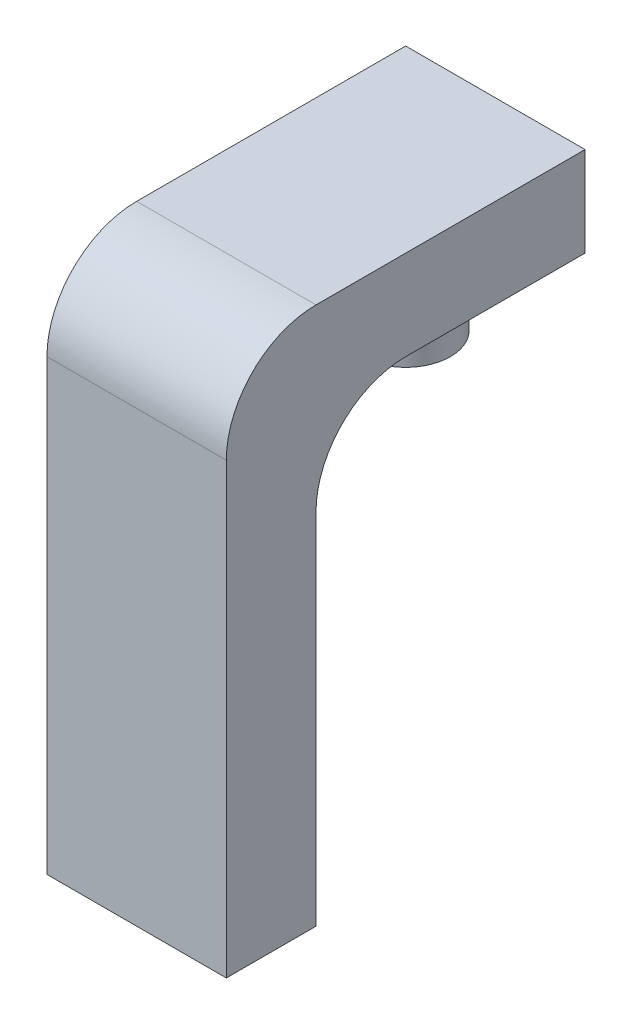
ISO-10303-21;
HEADER;
FILE_DESCRIPTION(('STEP AP214'),'2;1');
FILE_NAME('part.step','',(''),(''),'','','');
FILE_SCHEMA(('AUTOMOTIVE_DESIGN { 1 0 10303 214 1 1 1 1 }'));
ENDSEC;
DATA;
#1=APPLICATION_CONTEXT('core data for automotive mechanical design processes');
#2=APPLICATION_PROTOCOL_DEFINITION('international standard','automotive_design',2000,#1);
#3=PRODUCT_CONTEXT('',#1,'mechanical');
#4=PRODUCT('Part','Part','',(#3));
#5=PRODUCT_RELATED_PRODUCT_CATEGORY('part','',(#4));
#6=PRODUCT_DEFINITION_FORMATION('','',#4);
#7=PRODUCT_DEFINITION_CONTEXT('part definition',#1,'design');
#8=PRODUCT_DEFINITION('design','',#6,#7);
#9=PRODUCT_DEFINITION_SHAPE('','',#8);
#10=(LENGTH_UNIT() NAMED_UNIT(*) SI_UNIT(.MILLI.,.METRE.));
#11=(NAMED_UNIT(*) PLANE_ANGLE_UNIT() SI_UNIT($,.RADIAN.));
#12=(NAMED_UNIT(*) SI_UNIT($,.STERADIAN.) SOLID_ANGLE_UNIT());
#13=UNCERTAINTY_MEASURE_WITH_UNIT(LENGTH_MEASURE(1.E-05),#10,'distance_accuracy_value','');
#14=(GEOMETRIC_REPRESENTATION_CONTEXT(3) GLOBAL_UNCERTAINTY_ASSIGNED_CONTEXT((#13)) GLOBAL_UNIT_ASSIGNED_CONTEXT((#10,
#11,#12)) REPRESENTATION_CONTEXT('',''));
#15=CARTESIAN_POINT('',(0.,0.,0.));
#16=DIRECTION('',(0.,0.,1.));
#17=DIRECTION('',(1.,0.,0.));
#18=AXIS2_PLACEMENT_3D('',#15,#16,#17);
#19=CARTESIAN_POINT('',(50.8,0.,0.));
#20=DIRECTION('',(0.,0.,-1.));
#21=DIRECTION('',(-1.,0.,0.));
#22=AXIS2_PLACEMENT_3D('',#19,#20,#21);
#23=PLANE('',#22);
#24=DIRECTION('',(0.,-1.,0.));
#25=VECTOR('',#24,1.);
#26=CARTESIAN_POINT('',(0.,0.,0.));
#27=LINE('',#26,#25);
#28=CARTESIAN_POINT('',(0.,127.,0.));
#29=VERTEX_POINT('',#28);
#30=CARTESIAN_POINT('',(0.,0.,0.));
#31=VERTEX_POINT('',#30);
#32=EDGE_CURVE('E129',#29,#31,#27,.T.);
#33=ORIENTED_EDGE('',*,*,#32,.T.);
#34=DIRECTION('',(-1.,0.,0.));
#35=VECTOR('',#34,1.);
#36=CARTESIAN_POINT('',(50.8,0.,0.));
#37=LINE('',#36,#35);
#38=CARTESIAN_POINT('',(50.8,0.,0.));
#39=VERTEX_POINT('',#38);
#40=EDGE_CURVE('E40',#39,#31,#37,.T.);
#41=ORIENTED_EDGE('',*,*,#40,.F.);
#42=DIRECTION('',(0.,-1.,0.));
#43=VECTOR('',#42,1.);
#44=CARTESIAN_POINT('',(50.8,0.,0.));
#45=LINE('',#44,#43);
#46=CARTESIAN_POINT('',(50.8,127.,0.));
#47=VERTEX_POINT('',#46);
#48=EDGE_CURVE('E144',#47,#39,#45,.T.);
#49=ORIENTED_EDGE('',*,*,#48,.F.);
#50=DIRECTION('',(-1.,0.,0.));
#51=VECTOR('',#50,1.);
#52=CARTESIAN_POINT('',(50.8,127.,0.));
#53=LINE('',#52,#51);
#54=EDGE_CURVE('E125',#47,#29,#53,.T.);
#55=ORIENTED_EDGE('',*,*,#54,.T.);
#56=EDGE_LOOP('',(#33,#41,#49,#55));
#57=FACE_BOUND('',#56,.T.);
#58=ADVANCED_FACE('F32',(#57),#23,.F.);
#59=CARTESIAN_POINT('',(50.8,0.,0.));
#60=DIRECTION('',(0.,1.,0.));
#61=DIRECTION('',(0.,0.,1.));
#62=AXIS2_PLACEMENT_3D('',#59,#60,#61);
#63=PLANE('',#62);
#64=DIRECTION('',(0.,0.,-1.));
#65=VECTOR('',#64,1.);
#66=CARTESIAN_POINT('',(0.,0.,0.));
#67=LINE('',#66,#65);
#68=CARTESIAN_POINT('',(0.,0.,-25.4));
#69=VERTEX_POINT('',#68);
#70=EDGE_CURVE('E132',#31,#69,#67,.T.);
#71=ORIENTED_EDGE('',*,*,#70,.T.);
#72=DIRECTION('',(-1.,0.,0.));
#73=VECTOR('',#72,1.);
#74=CARTESIAN_POINT('',(50.8,0.,-25.4));
#75=LINE('',#74,#73);
#76=CARTESIAN_POINT('',(50.8,0.,-25.4));
#77=VERTEX_POINT('',#76);
#78=EDGE_CURVE('E154',#77,#69,#75,.T.);
#79=ORIENTED_EDGE('',*,*,#78,.F.);
#80=DIRECTION('',(0.,0.,-1.));
#81=VECTOR('',#80,1.);
#82=CARTESIAN_POINT('',(50.8,0.,0.));
#83=LINE('',#82,#81);
#84=EDGE_CURVE('E92',#39,#77,#83,.T.);
#85=ORIENTED_EDGE('',*,*,#84,.F.);
#86=ORIENTED_EDGE('',*,*,#40,.T.);
#87=EDGE_LOOP('',(#71,#79,#85,#86));
#88=FACE_BOUND('',#87,.T.);
#89=ADVANCED_FACE('F157',(#88),#63,.F.);
#90=CARTESIAN_POINT('',(50.8,101.6,-25.4));
#91=DIRECTION('',(0.,0.,1.));
#92=DIRECTION('',(0.,-1.,0.));
#93=AXIS2_PLACEMENT_3D('',#90,#91,#92);
#94=PLANE('',#93);
#95=DIRECTION('',(0.,1.,0.));
#96=VECTOR('',#95,1.);
#97=CARTESIAN_POINT('',(0.,101.6,-25.4));
#98=LINE('',#97,#96);
#99=CARTESIAN_POINT('',(0.,101.6,-25.4));
#100=VERTEX_POINT('',#99);
#101=EDGE_CURVE('E135',#69,#100,#98,.T.);
#102=ORIENTED_EDGE('',*,*,#101,.T.);
#103=DIRECTION('',(-1.,0.,0.));
#104=VECTOR('',#103,1.);
#105=CARTESIAN_POINT('',(50.8,101.6,-25.4));
#106=LINE('',#105,#104);
#107=CARTESIAN_POINT('',(50.8,101.6,-25.4));
#108=VERTEX_POINT('',#107);
#109=EDGE_CURVE('E151',#108,#100,#106,.T.);
#110=ORIENTED_EDGE('',*,*,#109,.F.);
#111=DIRECTION('',(0.,1.,0.));
#112=VECTOR('',#111,1.);
#113=CARTESIAN_POINT('',(50.8,101.6,-25.4));
#114=LINE('',#113,#112);
#115=EDGE_CURVE('E175',#77,#108,#114,.T.);
#116=ORIENTED_EDGE('',*,*,#115,.F.);
#117=ORIENTED_EDGE('',*,*,#78,.T.);
#118=EDGE_LOOP('',(#102,#110,#116,#117));
#119=FACE_BOUND('',#118,.T.);
#120=ADVANCED_FACE('F168',(#119),#94,.F.);
#121=CARTESIAN_POINT('',(50.8,101.6,-50.8));
#122=DIRECTION('',(-1.,0.,0.));
#123=DIRECTION('',(0.,0.,1.));
#124=AXIS2_PLACEMENT_3D('',#121,#122,#123);
#125=CYLINDRICAL_SURFACE('',#124,25.4);
#126=CARTESIAN_POINT('',(0.,101.6,-50.8));
#127=DIRECTION('',(-1.,0.,0.));
#128=DIRECTION('',(0.,0.,-1.));
#129=AXIS2_PLACEMENT_3D('',#126,#127,#128);
#130=CIRCLE('',#129,25.4);
#131=CARTESIAN_POINT('',(0.,127.,-50.8));
#132=VERTEX_POINT('',#131);
#133=EDGE_CURVE('E137',#100,#132,#130,.T.);
#134=ORIENTED_EDGE('',*,*,#133,.T.);
#135=DIRECTION('',(-1.,0.,0.));
#136=VECTOR('',#135,1.);
#137=CARTESIAN_POINT('',(50.8,127.,-50.8));
#138=LINE('',#137,#136);
#139=CARTESIAN_POINT('',(50.8,127.,-50.8));
#140=VERTEX_POINT('',#139);
#141=EDGE_CURVE('E148',#140,#132,#138,.T.);
#142=ORIENTED_EDGE('',*,*,#141,.F.);
#143=CARTESIAN_POINT('',(50.8,101.6,-50.8));
#144=DIRECTION('',(-1.,0.,0.));
#145=DIRECTION('',(0.,0.,-1.));
#146=AXIS2_PLACEMENT_3D('',#143,#144,#145);
#147=CIRCLE('',#146,25.4);
#148=EDGE_CURVE('E174',#108,#140,#147,.T.);
#149=ORIENTED_EDGE('',*,*,#148,.F.);
#150=ORIENTED_EDGE('',*,*,#109,.T.);
#151=EDGE_LOOP('',(#134,#142,#149,#150));
#152=FACE_BOUND('',#151,.T.);
#153=ADVANCED_FACE('F172',(#152),#125,.F.);
#154=CARTESIAN_POINT('',(50.8,127.,-101.6));
#155=DIRECTION('',(0.,1.,0.));
#156=DIRECTION('',(0.,0.,1.));
#157=AXIS2_PLACEMENT_3D('',#154,#155,#156);
#158=PLANE('',#157);
#159=CARTESIAN_POINT('',(25.4,127.,-76.2));
#160=DIRECTION('',(0.,1.,0.));
#161=DIRECTION('',(0.,0.,1.));
#162=AXIS2_PLACEMENT_3D('',#159,#160,#161);
#163=CIRCLE('',#162,12.7);
#164=CARTESIAN_POINT('',(25.4,127.,-63.5));
#165=VERTEX_POINT('',#164);
#166=EDGE_CURVE('E11',#165,#165,#163,.F.);
#167=ORIENTED_EDGE('',*,*,#166,.F.);
#168=EDGE_LOOP('',(#167));
#169=FACE_BOUND('',#168,.T.);
#170=DIRECTION('',(0.,0.,-1.));
#171=VECTOR('',#170,1.);
#172=CARTESIAN_POINT('',(0.,127.,-101.6));
#173=LINE('',#172,#171);
#174=CARTESIAN_POINT('',(0.,127.,-101.6));
#175=VERTEX_POINT('',#174);
#176=EDGE_CURVE('E139',#132,#175,#173,.T.);
#177=ORIENTED_EDGE('',*,*,#176,.T.);
#178=DIRECTION('',(-1.,0.,0.));
#179=VECTOR('',#178,1.);
#180=CARTESIAN_POINT('',(50.8,127.,-101.6));
#181=LINE('',#180,#179);
#182=CARTESIAN_POINT('',(50.8,127.,-101.6));
#183=VERTEX_POINT('',#182);
#184=EDGE_CURVE('E120',#183,#175,#181,.T.);
#185=ORIENTED_EDGE('',*,*,#184,.F.);
#186=DIRECTION('',(0.,0.,-1.));
#187=VECTOR('',#186,1.);
#188=CARTESIAN_POINT('',(50.8,127.,-101.6));
#189=LINE('',#188,#187);
#190=EDGE_CURVE('E111',#140,#183,#189,.T.);
#191=ORIENTED_EDGE('',*,*,#190,.F.);
#192=ORIENTED_EDGE('',*,*,#141,.T.);
#193=EDGE_LOOP('',(#177,#185,#191,#192));
#194=FACE_BOUND('',#193,.T.);
#195=ADVANCED_FACE('F192',(#169,#194),#158,.F.);
#196=CARTESIAN_POINT('',(50.8,152.4,-101.6));
#197=DIRECTION('',(0.,0.,1.));
#198=DIRECTION('',(1.,0.,0.));
#199=AXIS2_PLACEMENT_3D('',#196,#197,#198);
#200=PLANE('',#199);
#201=DIRECTION('',(0.,1.,0.));
#202=VECTOR('',#201,1.);
#203=CARTESIAN_POINT('',(0.,152.4,-101.6));
#204=LINE('',#203,#202);
#205=CARTESIAN_POINT('',(0.,152.4,-101.6));
#206=VERTEX_POINT('',#205);
#207=EDGE_CURVE('E119',#175,#206,#204,.T.);
#208=ORIENTED_EDGE('',*,*,#207,.T.);
#209=DIRECTION('',(-1.,0.,0.));
#210=VECTOR('',#209,1.);
#211=CARTESIAN_POINT('',(50.8,152.4,-101.6));
#212=LINE('',#211,#210);
#213=CARTESIAN_POINT('',(50.8,152.4,-101.6));
#214=VERTEX_POINT('',#213);
#215=EDGE_CURVE('E116',#214,#206,#212,.T.);
#216=ORIENTED_EDGE('',*,*,#215,.F.);
#217=DIRECTION('',(0.,1.,0.));
#218=VECTOR('',#217,1.);
#219=CARTESIAN_POINT('',(50.8,152.4,-101.6));
#220=LINE('',#219,#218);
#221=EDGE_CURVE('E105',#183,#214,#220,.T.);
#222=ORIENTED_EDGE('',*,*,#221,.F.);
#223=ORIENTED_EDGE('',*,*,#184,.T.);
#224=EDGE_LOOP('',(#208,#216,#222,#223));
#225=FACE_BOUND('',#224,.T.);
#226=ADVANCED_FACE('F117',(#225),#200,.F.);
#227=CARTESIAN_POINT('',(50.8,152.4,-25.4));
#228=DIRECTION('',(0.,-1.,0.));
#229=DIRECTION('',(0.,0.,-1.));
#230=AXIS2_PLACEMENT_3D('',#227,#228,#229);
#231=PLANE('',#230);
#232=DIRECTION('',(0.,0.,1.));
#233=VECTOR('',#232,1.);
#234=CARTESIAN_POINT('',(0.,152.4,-25.4));
#235=LINE('',#234,#233);
#236=CARTESIAN_POINT('',(0.,152.4,-25.4));
#237=VERTEX_POINT('',#236);
#238=EDGE_CURVE('E77',#206,#237,#235,.T.);
#239=ORIENTED_EDGE('',*,*,#238,.T.);
#240=DIRECTION('',(-1.,0.,0.));
#241=VECTOR('',#240,1.);
#242=CARTESIAN_POINT('',(50.8,152.4,-25.4));
#243=LINE('',#242,#241);
#244=CARTESIAN_POINT('',(50.8,152.4,-25.4));
#245=VERTEX_POINT('',#244);
#246=EDGE_CURVE('E121',#245,#237,#243,.T.);
#247=ORIENTED_EDGE('',*,*,#246,.F.);
#248=DIRECTION('',(0.,0.,1.));
#249=VECTOR('',#248,1.);
#250=CARTESIAN_POINT('',(50.8,152.4,-25.4));
#251=LINE('',#250,#249);
#252=EDGE_CURVE('E109',#214,#245,#251,.T.);
#253=ORIENTED_EDGE('',*,*,#252,.F.);
#254=ORIENTED_EDGE('',*,*,#215,.T.);
#255=EDGE_LOOP('',(#239,#247,#253,#254));
#256=FACE_BOUND('',#255,.T.);
#257=ADVANCED_FACE('F123',(#256),#231,.F.);
#258=CARTESIAN_POINT('',(50.8,127.,-25.4));
#259=DIRECTION('',(-1.,0.,0.));
#260=DIRECTION('',(0.,0.,1.));
#261=AXIS2_PLACEMENT_3D('',#258,#259,#260);
#262=CYLINDRICAL_SURFACE('',#261,25.4);
#263=CARTESIAN_POINT('',(0.,127.,-25.4));
#264=DIRECTION('',(1.,0.,0.));
#265=DIRECTION('',(0.,0.,1.));
#266=AXIS2_PLACEMENT_3D('',#263,#264,#265);
#267=CIRCLE('',#266,25.4);
#268=EDGE_CURVE('E83',#237,#29,#267,.T.);
#269=ORIENTED_EDGE('',*,*,#268,.T.);
#270=ORIENTED_EDGE('',*,*,#54,.F.);
#271=CARTESIAN_POINT('',(50.8,127.,-25.4));
#272=DIRECTION('',(1.,0.,0.));
#273=DIRECTION('',(0.,0.,1.));
#274=AXIS2_PLACEMENT_3D('',#271,#272,#273);
#275=CIRCLE('',#274,25.4);
#276=EDGE_CURVE('E48',#245,#47,#275,.T.);
#277=ORIENTED_EDGE('',*,*,#276,.F.);
#278=ORIENTED_EDGE('',*,*,#246,.T.);
#279=EDGE_LOOP('',(#269,#270,#277,#278));
#280=FACE_BOUND('',#279,.T.);
#281=ADVANCED_FACE('F232',(#280),#262,.T.);
#282=CARTESIAN_POINT('',(50.8,127.,-25.4));
#283=DIRECTION('',(-1.,0.,0.));
#284=DIRECTION('',(0.,0.,1.));
#285=AXIS2_PLACEMENT_3D('',#282,#283,#284);
#286=PLANE('',#285);
#287=ORIENTED_EDGE('',*,*,#48,.T.);
#288=ORIENTED_EDGE('',*,*,#84,.T.);
#289=ORIENTED_EDGE('',*,*,#115,.T.);
#290=ORIENTED_EDGE('',*,*,#148,.T.);
#291=ORIENTED_EDGE('',*,*,#190,.T.);
#292=ORIENTED_EDGE('',*,*,#221,.T.);
#293=ORIENTED_EDGE('',*,*,#252,.T.);
#294=ORIENTED_EDGE('',*,*,#276,.T.);
#295=EDGE_LOOP('',(#287,#288,#289,#290,#291,#292,#293,#294));
#296=FACE_BOUND('',#295,.T.);
#297=ADVANCED_FACE('F107',(#296),#286,.F.);
#298=CARTESIAN_POINT('',(0.,127.,-25.4));
#299=DIRECTION('',(-1.,0.,0.));
#300=DIRECTION('',(0.,0.,1.));
#301=AXIS2_PLACEMENT_3D('',#298,#299,#300);
#302=PLANE('',#301);
#303=ORIENTED_EDGE('',*,*,#32,.F.);
#304=ORIENTED_EDGE('',*,*,#268,.F.);
#305=ORIENTED_EDGE('',*,*,#238,.F.);
#306=ORIENTED_EDGE('',*,*,#207,.F.);
#307=ORIENTED_EDGE('',*,*,#176,.F.);
#308=ORIENTED_EDGE('',*,*,#133,.F.);
#309=ORIENTED_EDGE('',*,*,#101,.F.);
#310=ORIENTED_EDGE('',*,*,#70,.F.);
#311=EDGE_LOOP('',(#303,#304,#305,#306,#307,#308,#309,#310));
#312=FACE_BOUND('',#311,.T.);
#313=ADVANCED_FACE('F162',(#312),#302,.T.);
#314=CARTESIAN_POINT('',(25.4,107.95,-76.2));
#315=DIRECTION('',(0.,1.,0.));
#316=DIRECTION('',(0.,0.,1.));
#317=AXIS2_PLACEMENT_3D('',#314,#315,#316);
#318=CYLINDRICAL_SURFACE('',#317,12.7);
#319=CARTESIAN_POINT('',(25.4,107.95,-76.2));
#320=DIRECTION('',(0.,-1.,0.));
#321=DIRECTION('',(0.,0.,-1.));
#322=AXIS2_PLACEMENT_3D('',#319,#320,#321);
#323=CIRCLE('',#322,12.7);
#324=CARTESIAN_POINT('',(25.4,107.95,-88.9));
#325=VERTEX_POINT('',#324);
#326=EDGE_CURVE('E133',#325,#325,#323,.T.);
#327=ORIENTED_EDGE('',*,*,#326,.F.);
#328=EDGE_LOOP('',(#327));
#329=FACE_BOUND('',#328,.T.);
#330=ORIENTED_EDGE('',*,*,#166,.T.);
#331=EDGE_LOOP('',(#330));
#332=FACE_BOUND('',#331,.T.);
#333=ADVANCED_FACE('F186',(#329,#332),#318,.T.);
#334=CARTESIAN_POINT('',(25.4,107.95,-76.2));
#335=DIRECTION('',(0.,-1.,0.));
#336=DIRECTION('',(0.,0.,-1.));
#337=AXIS2_PLACEMENT_3D('',#334,#335,#336);
#338=PLANE('',#337);
#339=ORIENTED_EDGE('',*,*,#326,.T.);
#340=EDGE_LOOP('',(#339));
#341=FACE_BOUND('',#340,.T.);
#342=ADVANCED_FACE('F184',(#341),#338,.T.);
#343=CLOSED_SHELL('',(#58,#89,#120,#153,#195,#226,#257,#281,#297,#313,#333,#342));
#344=MANIFOLD_SOLID_BREP('B2',#343);
#345=ADVANCED_BREP_SHAPE_REPRESENTATION('',(#18,#344),#14);
#346=SHAPE_DEFINITION_REPRESENTATION(#9,#345);
ENDSEC;
END-ISO-10303-21;
